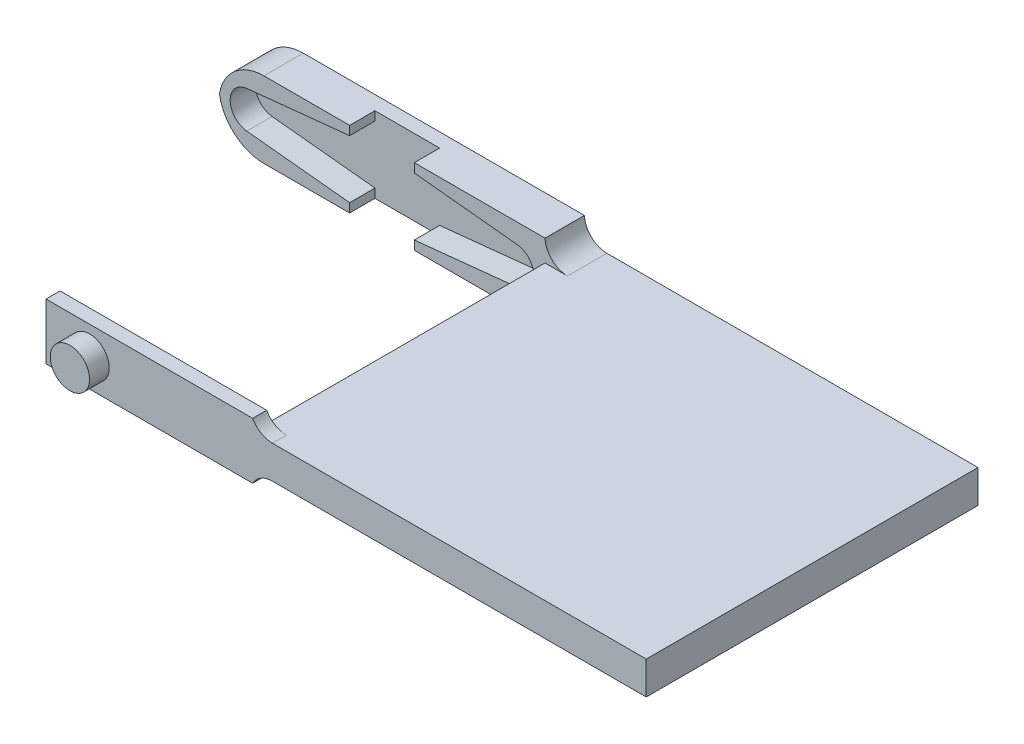
ISO-10303-21;
HEADER;
FILE_DESCRIPTION(('STEP AP214'),'2;1');
FILE_NAME('part.step','',(''),(''),'','','');
FILE_SCHEMA(('AUTOMOTIVE_DESIGN { 1 0 10303 214 1 1 1 1 }'));
ENDSEC;
DATA;
#1=APPLICATION_CONTEXT('core data for automotive mechanical design processes');
#2=APPLICATION_PROTOCOL_DEFINITION('international standard','automotive_design',2000,#1);
#3=PRODUCT_CONTEXT('',#1,'mechanical');
#4=PRODUCT('Part','Part','',(#3));
#5=PRODUCT_RELATED_PRODUCT_CATEGORY('part','',(#4));
#6=PRODUCT_DEFINITION_FORMATION('','',#4);
#7=PRODUCT_DEFINITION_CONTEXT('part definition',#1,'design');
#8=PRODUCT_DEFINITION('design','',#6,#7);
#9=PRODUCT_DEFINITION_SHAPE('','',#8);
#10=(LENGTH_UNIT() NAMED_UNIT(*) SI_UNIT(.MILLI.,.METRE.));
#11=(NAMED_UNIT(*) PLANE_ANGLE_UNIT() SI_UNIT($,.RADIAN.));
#12=(NAMED_UNIT(*) SI_UNIT($,.STERADIAN.) SOLID_ANGLE_UNIT());
#13=UNCERTAINTY_MEASURE_WITH_UNIT(LENGTH_MEASURE(1.E-05),#10,'distance_accuracy_value','');
#14=(GEOMETRIC_REPRESENTATION_CONTEXT(3) GLOBAL_UNCERTAINTY_ASSIGNED_CONTEXT((#13)) GLOBAL_UNIT_ASSIGNED_CONTEXT((#10,
#11,#12)) REPRESENTATION_CONTEXT('',''));
#15=CARTESIAN_POINT('',(0.,0.,0.));
#16=DIRECTION('',(0.,0.,1.));
#17=DIRECTION('',(1.,0.,0.));
#18=AXIS2_PLACEMENT_3D('',#15,#16,#17);
#19=CARTESIAN_POINT('',(0.,0.,3.5));
#20=DIRECTION('',(0.,0.,1.));
#21=DIRECTION('',(1.,0.,0.));
#22=AXIS2_PLACEMENT_3D('',#19,#20,#21);
#23=PLANE('',#22);
#24=DIRECTION('',(0.,1.,0.));
#25=VECTOR('',#24,1.);
#26=CARTESIAN_POINT('',(2.875,0.,3.5));
#27=LINE('',#26,#25);
#28=CARTESIAN_POINT('',(2.875,0.,3.5));
#29=VERTEX_POINT('',#28);
#30=CARTESIAN_POINT('',(2.875,0.795101343833628,3.5));
#31=VERTEX_POINT('',#30);
#32=EDGE_CURVE('E305',#29,#31,#27,.T.);
#33=ORIENTED_EDGE('',*,*,#32,.F.);
#34=DIRECTION('',(1.,0.,0.));
#35=VECTOR('',#34,1.);
#36=CARTESIAN_POINT('',(0.,0.,3.5));
#37=LINE('',#36,#35);
#38=CARTESIAN_POINT('',(14.5,0.,3.5));
#39=VERTEX_POINT('',#38);
#40=EDGE_CURVE('E517',#29,#39,#37,.T.);
#41=ORIENTED_EDGE('',*,*,#40,.T.);
#42=CARTESIAN_POINT('',(16.4981037237807,-0.0870718612048299,3.5));
#43=DIRECTION('',(0.,0.,1.));
#44=DIRECTION('',(1.,0.,0.));
#45=AXIS2_PLACEMENT_3D('',#42,#43,#44);
#46=CIRCLE('',#45,2.);
#47=CARTESIAN_POINT('',(16.4981037237807,1.91292813879517,3.5));
#48=VERTEX_POINT('',#47);
#49=EDGE_CURVE('E390',#39,#48,#46,.F.);
#50=ORIENTED_EDGE('',*,*,#49,.T.);
#51=DIRECTION('',(1.,0.,0.));
#52=VECTOR('',#51,1.);
#53=CARTESIAN_POINT('',(0.,1.91292813879517,3.5));
#54=LINE('',#53,#52);
#55=CARTESIAN_POINT('',(14.5,1.91292813879517,3.5));
#56=VERTEX_POINT('',#55);
#57=EDGE_CURVE('E757',#56,#48,#54,.T.);
#58=ORIENTED_EDGE('',*,*,#57,.F.);
#59=DIRECTION('',(0.,-1.,0.));
#60=VECTOR('',#59,1.);
#61=CARTESIAN_POINT('',(14.5,0.,3.5));
#62=LINE('',#61,#60);
#63=CARTESIAN_POINT('',(14.5,4.83707186120483,3.5));
#64=VERTEX_POINT('',#63);
#65=EDGE_CURVE('E347',#64,#56,#62,.T.);
#66=ORIENTED_EDGE('',*,*,#65,.F.);
#67=DIRECTION('',(-1.,0.,0.));
#68=VECTOR('',#67,1.);
#69=CARTESIAN_POINT('',(0.,4.83707186120483,3.5));
#70=LINE('',#69,#68);
#71=CARTESIAN_POINT('',(16.4981037237807,4.83707186120483,3.5));
#72=VERTEX_POINT('',#71);
#73=EDGE_CURVE('E382',#72,#64,#70,.T.);
#74=ORIENTED_EDGE('',*,*,#73,.F.);
#75=CARTESIAN_POINT('',(16.4981037237807,6.83707186120483,3.5));
#76=DIRECTION('',(0.,0.,1.));
#77=DIRECTION('',(1.,0.,0.));
#78=AXIS2_PLACEMENT_3D('',#75,#76,#77);
#79=CIRCLE('',#78,2.);
#80=CARTESIAN_POINT('',(14.5,6.75,3.5));
#81=VERTEX_POINT('',#80);
#82=EDGE_CURVE('E394',#72,#81,#79,.F.);
#83=ORIENTED_EDGE('',*,*,#82,.T.);
#84=DIRECTION('',(1.,0.,0.));
#85=VECTOR('',#84,1.);
#86=CARTESIAN_POINT('',(0.,6.75,3.5));
#87=LINE('',#86,#85);
#88=CARTESIAN_POINT('',(2.875,6.75,3.5));
#89=VERTEX_POINT('',#88);
#90=EDGE_CURVE('E515',#89,#81,#87,.T.);
#91=ORIENTED_EDGE('',*,*,#90,.F.);
#92=DIRECTION('',(0.,1.,0.));
#93=VECTOR('',#92,1.);
#94=CARTESIAN_POINT('',(2.875,6.75,3.5));
#95=LINE('',#94,#93);
#96=CARTESIAN_POINT('',(2.875,5.95489865616637,3.5));
#97=VERTEX_POINT('',#96);
#98=EDGE_CURVE('E527',#97,#89,#95,.T.);
#99=ORIENTED_EDGE('',*,*,#98,.F.);
#100=DIRECTION('',(-0.994773374070749,0.102107464173283,0.));
#101=VECTOR('',#100,1.);
#102=CARTESIAN_POINT('',(0.634836166584157,6.18483791100064,3.5));
#103=LINE('',#102,#101);
#104=CARTESIAN_POINT('',(12.0184773158859,5.01637606721673,3.5));
#105=VERTEX_POINT('',#104);
#106=EDGE_CURVE('E333',#105,#97,#103,.T.);
#107=ORIENTED_EDGE('',*,*,#106,.F.);
#108=CARTESIAN_POINT('',(11.85,3.375,3.5));
#109=DIRECTION('',(0.,0.,1.));
#110=DIRECTION('',(1.,0.,0.));
#111=AXIS2_PLACEMENT_3D('',#108,#109,#110);
#112=CIRCLE('',#111,1.64999999999999);
#113=CARTESIAN_POINT('',(12.0184773158859,1.73362393278327,3.5));
#114=VERTEX_POINT('',#113);
#115=EDGE_CURVE('E326',#105,#114,#112,.F.);
#116=ORIENTED_EDGE('',*,*,#115,.T.);
#117=DIRECTION('',(-0.994773374070749,-0.102107464173284,0.));
#118=VECTOR('',#117,1.);
#119=CARTESIAN_POINT('',(-0.0507868933267326,0.49478703288005,3.5));
#120=LINE('',#119,#118);
#121=EDGE_CURVE('E320',#114,#31,#120,.T.);
#122=ORIENTED_EDGE('',*,*,#121,.T.);
#123=EDGE_LOOP('',(#33,#41,#50,#58,#66,#74,#83,#91,#99,#107,#116,#122));
#124=FACE_BOUND('',#123,.T.);
#125=ADVANCED_FACE('F114',(#124),#23,.T.);
#126=CARTESIAN_POINT('',(0.,0.,29.5));
#127=DIRECTION('',(0.,0.,1.));
#128=DIRECTION('',(1.,0.,0.));
#129=AXIS2_PLACEMENT_3D('',#126,#127,#128);
#130=PLANE('',#129);
#131=DIRECTION('',(1.,0.,0.));
#132=VECTOR('',#131,1.);
#133=CARTESIAN_POINT('',(0.,4.83707186120483,29.5));
#134=LINE('',#133,#132);
#135=CARTESIAN_POINT('',(16.2534017605437,4.83707186120483,29.5));
#136=VERTEX_POINT('',#135);
#137=CARTESIAN_POINT('',(49.5,4.83707186120483,29.5));
#138=VERTEX_POINT('',#137);
#139=EDGE_CURVE('E476',#136,#138,#134,.T.);
#140=ORIENTED_EDGE('',*,*,#139,.F.);
#141=CARTESIAN_POINT('',(16.2534017605437,6.83707186120483,29.5));
#142=DIRECTION('',(0.,0.,1.));
#143=DIRECTION('',(1.,0.,0.));
#144=AXIS2_PLACEMENT_3D('',#141,#142,#143);
#145=CIRCLE('',#144,2.);
#146=CARTESIAN_POINT('',(14.5,5.875,29.5));
#147=VERTEX_POINT('',#146);
#148=EDGE_CURVE('E403',#136,#147,#145,.F.);
#149=ORIENTED_EDGE('',*,*,#148,.T.);
#150=DIRECTION('',(-1.,0.,0.));
#151=VECTOR('',#150,1.);
#152=CARTESIAN_POINT('',(13.5,5.875,29.5));
#153=LINE('',#152,#151);
#154=CARTESIAN_POINT('',(-3.875,5.875,29.5));
#155=VERTEX_POINT('',#154);
#156=EDGE_CURVE('E453',#147,#155,#153,.T.);
#157=ORIENTED_EDGE('',*,*,#156,.T.);
#158=DIRECTION('',(0.,-1.,0.));
#159=VECTOR('',#158,1.);
#160=CARTESIAN_POINT('',(-3.875,5.875,29.5));
#161=LINE('',#160,#159);
#162=CARTESIAN_POINT('',(-3.875,0.875000000000001,29.5));
#163=VERTEX_POINT('',#162);
#164=EDGE_CURVE('E464',#155,#163,#161,.T.);
#165=ORIENTED_EDGE('',*,*,#164,.T.);
#166=DIRECTION('',(-1.,0.,0.));
#167=VECTOR('',#166,1.);
#168=CARTESIAN_POINT('',(14.5,0.874999999999997,29.5));
#169=LINE('',#168,#167);
#170=CARTESIAN_POINT('',(14.5,0.874999999999997,29.5));
#171=VERTEX_POINT('',#170);
#172=EDGE_CURVE('E447',#171,#163,#169,.T.);
#173=ORIENTED_EDGE('',*,*,#172,.F.);
#174=CARTESIAN_POINT('',(16.2534017605437,-0.0870718612048299,29.5));
#175=DIRECTION('',(0.,0.,1.));
#176=DIRECTION('',(1.,0.,0.));
#177=AXIS2_PLACEMENT_3D('',#174,#175,#176);
#178=CIRCLE('',#177,2.);
#179=CARTESIAN_POINT('',(16.2534017605437,1.91292813879517,29.5));
#180=VERTEX_POINT('',#179);
#181=EDGE_CURVE('E399',#171,#180,#178,.F.);
#182=ORIENTED_EDGE('',*,*,#181,.T.);
#183=DIRECTION('',(1.,0.,0.));
#184=VECTOR('',#183,1.);
#185=CARTESIAN_POINT('',(0.,1.91292813879517,29.5));
#186=LINE('',#185,#184);
#187=CARTESIAN_POINT('',(49.5,1.91292813879517,29.5));
#188=VERTEX_POINT('',#187);
#189=EDGE_CURVE('E478',#180,#188,#186,.T.);
#190=ORIENTED_EDGE('',*,*,#189,.T.);
#191=DIRECTION('',(0.,-1.,0.));
#192=VECTOR('',#191,1.);
#193=CARTESIAN_POINT('',(49.5,0.,29.5));
#194=LINE('',#193,#192);
#195=EDGE_CURVE('E481',#138,#188,#194,.T.);
#196=ORIENTED_EDGE('',*,*,#195,.F.);
#197=EDGE_LOOP('',(#140,#149,#157,#165,#173,#182,#190,#196));
#198=FACE_BOUND('',#197,.T.);
#199=CARTESIAN_POINT('',(0.,3.375,29.5));
#200=DIRECTION('',(0.,0.,1.));
#201=DIRECTION('',(1.,0.,0.));
#202=AXIS2_PLACEMENT_3D('',#199,#200,#201);
#203=CIRCLE('',#202,1.75);
#204=CARTESIAN_POINT('',(1.75,3.375,29.5));
#205=VERTEX_POINT('',#204);
#206=EDGE_CURVE('E431',#205,#205,#203,.T.);
#207=ORIENTED_EDGE('',*,*,#206,.F.);
#208=EDGE_LOOP('',(#207));
#209=FACE_BOUND('',#208,.T.);
#210=ADVANCED_FACE('F569',(#198,#209),#130,.T.);
#211=CARTESIAN_POINT('',(0.634836166584157,6.18483791100064,3.5));
#212=DIRECTION('',(-0.102107464173283,-0.994773374070749,0.));
#213=DIRECTION('',(0.994773374070749,-0.102107464173283,0.));
#214=AXIS2_PLACEMENT_3D('',#211,#212,#213);
#215=PLANE('',#214);
#216=DIRECTION('',(0.,0.,1.));
#217=VECTOR('',#216,1.);
#218=CARTESIAN_POINT('',(2.875,5.95489865616637,-4.55471240863542));
#219=LINE('',#218,#217);
#220=CARTESIAN_POINT('',(2.875,5.95489865616637,1.25));
#221=VERTEX_POINT('',#220);
#222=EDGE_CURVE('E524',#221,#97,#219,.T.);
#223=ORIENTED_EDGE('',*,*,#222,.F.);
#224=DIRECTION('',(-0.994773374070749,0.102107464173283,0.));
#225=VECTOR('',#224,1.);
#226=CARTESIAN_POINT('',(0.634836166584157,6.18483791100064,1.25));
#227=LINE('',#226,#225);
#228=CARTESIAN_POINT('',(12.0184773158859,5.01637606721673,1.25));
#229=VERTEX_POINT('',#228);
#230=EDGE_CURVE('E501',#229,#221,#227,.T.);
#231=ORIENTED_EDGE('',*,*,#230,.F.);
#232=DIRECTION('',(0.,0.,-1.));
#233=VECTOR('',#232,1.);
#234=CARTESIAN_POINT('',(12.0184773158859,5.01637606721673,3.5));
#235=LINE('',#234,#233);
#236=EDGE_CURVE('E357',#105,#229,#235,.T.);
#237=ORIENTED_EDGE('',*,*,#236,.F.);
#238=ORIENTED_EDGE('',*,*,#106,.T.);
#239=EDGE_LOOP('',(#223,#231,#237,#238));
#240=FACE_BOUND('',#239,.T.);
#241=ADVANCED_FACE('F522',(#240),#215,.T.);
#242=CARTESIAN_POINT('',(11.85,3.375,3.5));
#243=DIRECTION('',(0.,0.,-1.));
#244=DIRECTION('',(-1.,0.,0.));
#245=AXIS2_PLACEMENT_3D('',#242,#243,#244);
#246=CYLINDRICAL_SURFACE('',#245,1.64999999999999);
#247=ORIENTED_EDGE('',*,*,#236,.T.);
#248=CARTESIAN_POINT('',(11.85,3.375,1.25));
#249=DIRECTION('',(0.,0.,1.));
#250=DIRECTION('',(1.,0.,0.));
#251=AXIS2_PLACEMENT_3D('',#248,#249,#250);
#252=CIRCLE('',#251,1.64999999999999);
#253=CARTESIAN_POINT('',(12.0184773158859,1.73362393278327,1.25));
#254=VERTEX_POINT('',#253);
#255=EDGE_CURVE('E498',#229,#254,#252,.F.);
#256=ORIENTED_EDGE('',*,*,#255,.T.);
#257=DIRECTION('',(0.,0.,-1.));
#258=VECTOR('',#257,1.);
#259=CARTESIAN_POINT('',(12.0184773158859,1.73362393278327,3.5));
#260=LINE('',#259,#258);
#261=EDGE_CURVE('E355',#114,#254,#260,.T.);
#262=ORIENTED_EDGE('',*,*,#261,.F.);
#263=ORIENTED_EDGE('',*,*,#115,.F.);
#264=EDGE_LOOP('',(#247,#256,#262,#263));
#265=FACE_BOUND('',#264,.T.);
#266=ADVANCED_FACE('F561',(#265),#246,.F.);
#267=CARTESIAN_POINT('',(-0.0507868933267326,0.49478703288005,3.5));
#268=DIRECTION('',(0.102107464173283,-0.994773374070749,0.));
#269=DIRECTION('',(0.994773374070749,0.102107464173284,0.));
#270=AXIS2_PLACEMENT_3D('',#267,#268,#269);
#271=PLANE('',#270);
#272=DIRECTION('',(-0.994773374070749,-0.102107464173284,0.));
#273=VECTOR('',#272,1.);
#274=CARTESIAN_POINT('',(-0.0507868933267326,0.49478703288005,1.25));
#275=LINE('',#274,#273);
#276=CARTESIAN_POINT('',(2.875,0.795101343833628,1.25));
#277=VERTEX_POINT('',#276);
#278=EDGE_CURVE('E322',#254,#277,#275,.T.);
#279=ORIENTED_EDGE('',*,*,#278,.T.);
#280=DIRECTION('',(0.,0.,1.));
#281=VECTOR('',#280,1.);
#282=CARTESIAN_POINT('',(2.875,0.795101343833628,-4.55471240863542));
#283=LINE('',#282,#281);
#284=EDGE_CURVE('E308',#277,#31,#283,.T.);
#285=ORIENTED_EDGE('',*,*,#284,.T.);
#286=ORIENTED_EDGE('',*,*,#121,.F.);
#287=ORIENTED_EDGE('',*,*,#261,.T.);
#288=EDGE_LOOP('',(#279,#285,#286,#287));
#289=FACE_BOUND('',#288,.T.);
#290=ADVANCED_FACE('F318',(#289),#271,.F.);
#291=CARTESIAN_POINT('',(0.0507868933267324,0.49478703288005,3.5));
#292=DIRECTION('',(0.102107464173283,0.994773374070749,0.));
#293=DIRECTION('',(-0.994773374070749,0.102107464173283,0.));
#294=AXIS2_PLACEMENT_3D('',#291,#292,#293);
#295=PLANE('',#294);
#296=DIRECTION('',(0.,0.,1.));
#297=VECTOR('',#296,1.);
#298=CARTESIAN_POINT('',(-2.875,0.795101343833628,-4.55471240863542));
#299=LINE('',#298,#297);
#300=CARTESIAN_POINT('',(-2.875,0.795101343833628,1.25));
#301=VERTEX_POINT('',#300);
#302=CARTESIAN_POINT('',(-2.87500000000002,0.795101343833628,3.5));
#303=VERTEX_POINT('',#302);
#304=EDGE_CURVE('E130',#301,#303,#299,.T.);
#305=ORIENTED_EDGE('',*,*,#304,.F.);
#306=DIRECTION('',(0.994773374070749,-0.102107464173283,0.));
#307=VECTOR('',#306,1.);
#308=CARTESIAN_POINT('',(0.0507868933267324,0.49478703288005,1.25));
#309=LINE('',#308,#307);
#310=CARTESIAN_POINT('',(-12.0184773158859,1.73362393278327,1.25));
#311=VERTEX_POINT('',#310);
#312=EDGE_CURVE('E509',#311,#301,#309,.T.);
#313=ORIENTED_EDGE('',*,*,#312,.F.);
#314=DIRECTION('',(0.,0.,-1.));
#315=VECTOR('',#314,1.);
#316=CARTESIAN_POINT('',(-12.0184773158859,1.73362393278327,3.5));
#317=LINE('',#316,#315);
#318=CARTESIAN_POINT('',(-12.0184773158859,1.73362393278327,3.5));
#319=VERTEX_POINT('',#318);
#320=EDGE_CURVE('E351',#319,#311,#317,.T.);
#321=ORIENTED_EDGE('',*,*,#320,.F.);
#322=DIRECTION('',(0.994773374070749,-0.102107464173283,0.));
#323=VECTOR('',#322,1.);
#324=CARTESIAN_POINT('',(0.0507868933267324,0.49478703288005,3.5));
#325=LINE('',#324,#323);
#326=EDGE_CURVE('E328',#319,#303,#325,.T.);
#327=ORIENTED_EDGE('',*,*,#326,.T.);
#328=EDGE_LOOP('',(#305,#313,#321,#327));
#329=FACE_BOUND('',#328,.T.);
#330=ADVANCED_FACE('F552',(#329),#295,.T.);
#331=CARTESIAN_POINT('',(-11.85,3.375,3.5));
#332=DIRECTION('',(0.,0.,-1.));
#333=DIRECTION('',(-1.,0.,0.));
#334=AXIS2_PLACEMENT_3D('',#331,#332,#333);
#335=CYLINDRICAL_SURFACE('',#334,1.65);
#336=CARTESIAN_POINT('',(-11.85,3.375,1.25));
#337=DIRECTION('',(0.,0.,1.));
#338=DIRECTION('',(1.,0.,0.));
#339=AXIS2_PLACEMENT_3D('',#336,#337,#338);
#340=CIRCLE('',#339,1.65);
#341=CARTESIAN_POINT('',(-12.0184773158859,5.01637606721673,1.25));
#342=VERTEX_POINT('',#341);
#343=EDGE_CURVE('E507',#342,#311,#340,.T.);
#344=ORIENTED_EDGE('',*,*,#343,.F.);
#345=DIRECTION('',(0.,0.,-1.));
#346=VECTOR('',#345,1.);
#347=CARTESIAN_POINT('',(-12.0184773158859,5.01637606721673,3.5));
#348=LINE('',#347,#346);
#349=CARTESIAN_POINT('',(-12.0184773158859,5.01637606721673,3.5));
#350=VERTEX_POINT('',#349);
#351=EDGE_CURVE('E348',#350,#342,#348,.T.);
#352=ORIENTED_EDGE('',*,*,#351,.F.);
#353=CARTESIAN_POINT('',(-11.85,3.375,3.5));
#354=DIRECTION('',(0.,0.,1.));
#355=DIRECTION('',(1.,0.,0.));
#356=AXIS2_PLACEMENT_3D('',#353,#354,#355);
#357=CIRCLE('',#356,1.65);
#358=EDGE_CURVE('E331',#350,#319,#357,.T.);
#359=ORIENTED_EDGE('',*,*,#358,.T.);
#360=ORIENTED_EDGE('',*,*,#320,.T.);
#361=EDGE_LOOP('',(#344,#352,#359,#360));
#362=FACE_BOUND('',#361,.T.);
#363=ADVANCED_FACE('F547',(#362),#335,.F.);
#364=CARTESIAN_POINT('',(0.,6.75,3.5));
#365=DIRECTION('',(0.,1.,0.));
#366=DIRECTION('',(0.,0.,1.));
#367=AXIS2_PLACEMENT_3D('',#364,#365,#366);
#368=PLANE('',#367);
#369=DIRECTION('',(0.,0.,1.));
#370=VECTOR('',#369,1.);
#371=CARTESIAN_POINT('',(2.875,6.75,-4.55471240863542));
#372=LINE('',#371,#370);
#373=CARTESIAN_POINT('',(2.875,6.75,1.25));
#374=VERTEX_POINT('',#373);
#375=EDGE_CURVE('E537',#374,#89,#372,.T.);
#376=ORIENTED_EDGE('',*,*,#375,.T.);
#377=ORIENTED_EDGE('',*,*,#90,.T.);
#378=DIRECTION('',(0.,0.,-1.));
#379=VECTOR('',#378,1.);
#380=CARTESIAN_POINT('',(14.5,6.75,3.5));
#381=LINE('',#380,#379);
#382=CARTESIAN_POINT('',(14.5,6.75,0.));
#383=VERTEX_POINT('',#382);
#384=EDGE_CURVE('E352',#81,#383,#381,.T.);
#385=ORIENTED_EDGE('',*,*,#384,.T.);
#386=DIRECTION('',(1.,0.,0.));
#387=VECTOR('',#386,1.);
#388=CARTESIAN_POINT('',(0.,6.75,0.));
#389=LINE('',#388,#387);
#390=CARTESIAN_POINT('',(-10.5,6.75,0.));
#391=VERTEX_POINT('',#390);
#392=EDGE_CURVE('E343',#391,#383,#389,.T.);
#393=ORIENTED_EDGE('',*,*,#392,.F.);
#394=DIRECTION('',(0.,0.,-1.));
#395=VECTOR('',#394,1.);
#396=CARTESIAN_POINT('',(-10.5,6.75,3.5));
#397=LINE('',#396,#395);
#398=CARTESIAN_POINT('',(-10.5,6.75,3.5));
#399=VERTEX_POINT('',#398);
#400=EDGE_CURVE('E409',#391,#399,#397,.F.);
#401=ORIENTED_EDGE('',*,*,#400,.T.);
#402=CARTESIAN_POINT('',(-2.875,6.75,3.5));
#403=VERTEX_POINT('',#402);
#404=EDGE_CURVE('E421',#399,#403,#87,.T.);
#405=ORIENTED_EDGE('',*,*,#404,.T.);
#406=DIRECTION('',(0.,0.,1.));
#407=VECTOR('',#406,1.);
#408=CARTESIAN_POINT('',(-2.875,6.75,-4.55471240863542));
#409=LINE('',#408,#407);
#410=CARTESIAN_POINT('',(-2.875,6.75,1.25));
#411=VERTEX_POINT('',#410);
#412=EDGE_CURVE('E138',#411,#403,#409,.T.);
#413=ORIENTED_EDGE('',*,*,#412,.F.);
#414=DIRECTION('',(1.,0.,0.));
#415=VECTOR('',#414,1.);
#416=CARTESIAN_POINT('',(-2.875,6.75,1.25));
#417=LINE('',#416,#415);
#418=EDGE_CURVE('E436',#411,#374,#417,.T.);
#419=ORIENTED_EDGE('',*,*,#418,.T.);
#420=EDGE_LOOP('',(#376,#377,#385,#393,#401,#405,#413,#419));
#421=FACE_BOUND('',#420,.T.);
#422=ADVANCED_FACE('F592',(#421),#368,.T.);
#423=CARTESIAN_POINT('',(0.,0.,3.5));
#424=DIRECTION('',(0.,1.,0.));
#425=DIRECTION('',(-1.,0.,0.));
#426=AXIS2_PLACEMENT_3D('',#423,#424,#425);
#427=PLANE('',#426);
#428=ORIENTED_EDGE('',*,*,#40,.F.);
#429=DIRECTION('',(0.,0.,1.));
#430=VECTOR('',#429,1.);
#431=CARTESIAN_POINT('',(2.875,0.,-4.55471240863542));
#432=LINE('',#431,#430);
#433=CARTESIAN_POINT('',(2.875,0.,1.25));
#434=VERTEX_POINT('',#433);
#435=EDGE_CURVE('E311',#434,#29,#432,.T.);
#436=ORIENTED_EDGE('',*,*,#435,.F.);
#437=DIRECTION('',(-1.,0.,0.));
#438=VECTOR('',#437,1.);
#439=CARTESIAN_POINT('',(-2.875,0.,1.25));
#440=LINE('',#439,#438);
#441=CARTESIAN_POINT('',(-2.875,0.,1.25));
#442=VERTEX_POINT('',#441);
#443=EDGE_CURVE('E774',#434,#442,#440,.T.);
#444=ORIENTED_EDGE('',*,*,#443,.T.);
#445=DIRECTION('',(0.,0.,1.));
#446=VECTOR('',#445,1.);
#447=CARTESIAN_POINT('',(-2.875,0.,-4.55471240863542));
#448=LINE('',#447,#446);
#449=CARTESIAN_POINT('',(-2.875,0.,3.5));
#450=VERTEX_POINT('',#449);
#451=EDGE_CURVE('E553',#442,#450,#448,.T.);
#452=ORIENTED_EDGE('',*,*,#451,.T.);
#453=CARTESIAN_POINT('',(-10.5,0.,3.5));
#454=VERTEX_POINT('',#453);
#455=EDGE_CURVE('E518',#454,#450,#37,.T.);
#456=ORIENTED_EDGE('',*,*,#455,.F.);
#457=DIRECTION('',(0.,0.,-1.));
#458=VECTOR('',#457,1.);
#459=CARTESIAN_POINT('',(-10.5,0.,0.));
#460=LINE('',#459,#458);
#461=CARTESIAN_POINT('',(-10.5,0.,0.));
#462=VERTEX_POINT('',#461);
#463=EDGE_CURVE('E12',#454,#462,#460,.T.);
#464=ORIENTED_EDGE('',*,*,#463,.T.);
#465=DIRECTION('',(1.,0.,0.));
#466=VECTOR('',#465,1.);
#467=CARTESIAN_POINT('',(0.,0.,0.));
#468=LINE('',#467,#466);
#469=CARTESIAN_POINT('',(14.5,0.,0.));
#470=VERTEX_POINT('',#469);
#471=EDGE_CURVE('E345',#462,#470,#468,.T.);
#472=ORIENTED_EDGE('',*,*,#471,.T.);
#473=DIRECTION('',(0.,0.,-1.));
#474=VECTOR('',#473,1.);
#475=CARTESIAN_POINT('',(14.5,0.,3.5));
#476=LINE('',#475,#474);
#477=EDGE_CURVE('E342',#39,#470,#476,.T.);
#478=ORIENTED_EDGE('',*,*,#477,.F.);
#479=EDGE_LOOP('',(#428,#436,#444,#452,#456,#464,#472,#478));
#480=FACE_BOUND('',#479,.T.);
#481=ADVANCED_FACE('F587',(#480),#427,.F.);
#482=CARTESIAN_POINT('',(-0.634836166584157,6.18483791100064,3.5));
#483=DIRECTION('',(-0.102107464173283,0.994773374070749,0.));
#484=DIRECTION('',(-0.994773374070749,-0.102107464173283,0.));
#485=AXIS2_PLACEMENT_3D('',#482,#483,#484);
#486=PLANE('',#485);
#487=DIRECTION('',(0.994773374070749,0.102107464173283,0.));
#488=VECTOR('',#487,1.);
#489=CARTESIAN_POINT('',(-0.634836166584157,6.18483791100064,1.25));
#490=LINE('',#489,#488);
#491=CARTESIAN_POINT('',(-2.875,5.95489865616637,1.25));
#492=VERTEX_POINT('',#491);
#493=EDGE_CURVE('E504',#342,#492,#490,.T.);
#494=ORIENTED_EDGE('',*,*,#493,.T.);
#495=DIRECTION('',(0.,0.,1.));
#496=VECTOR('',#495,1.);
#497=CARTESIAN_POINT('',(-2.875,5.95489865616637,-4.55471240863542));
#498=LINE('',#497,#496);
#499=CARTESIAN_POINT('',(-2.875,5.95489865616637,3.5));
#500=VERTEX_POINT('',#499);
#501=EDGE_CURVE('E533',#492,#500,#498,.T.);
#502=ORIENTED_EDGE('',*,*,#501,.T.);
#503=DIRECTION('',(0.994773374070749,0.102107464173283,0.));
#504=VECTOR('',#503,1.);
#505=CARTESIAN_POINT('',(-0.634836166584157,6.18483791100064,3.5));
#506=LINE('',#505,#504);
#507=EDGE_CURVE('E339',#350,#500,#506,.T.);
#508=ORIENTED_EDGE('',*,*,#507,.F.);
#509=ORIENTED_EDGE('',*,*,#351,.T.);
#510=EDGE_LOOP('',(#494,#502,#508,#509));
#511=FACE_BOUND('',#510,.T.);
#512=ADVANCED_FACE('F542',(#511),#486,.F.);
#513=DIRECTION('',(0.,-1.,0.));
#514=VECTOR('',#513,1.);
#515=CARTESIAN_POINT('',(-2.875,0.,3.5));
#516=LINE('',#515,#514);
#517=EDGE_CURVE('E315',#303,#450,#516,.T.);
#518=ORIENTED_EDGE('',*,*,#517,.F.);
#519=ORIENTED_EDGE('',*,*,#326,.F.);
#520=ORIENTED_EDGE('',*,*,#358,.F.);
#521=ORIENTED_EDGE('',*,*,#507,.T.);
#522=DIRECTION('',(0.,-1.,0.));
#523=VECTOR('',#522,1.);
#524=CARTESIAN_POINT('',(-2.875,6.75,3.5));
#525=LINE('',#524,#523);
#526=EDGE_CURVE('E531',#403,#500,#525,.T.);
#527=ORIENTED_EDGE('',*,*,#526,.F.);
#528=ORIENTED_EDGE('',*,*,#404,.F.);
#529=CARTESIAN_POINT('',(-10.5,2.75,3.5));
#530=DIRECTION('',(0.,0.,1.));
#531=DIRECTION('',(1.,0.,0.));
#532=AXIS2_PLACEMENT_3D('',#529,#530,#531);
#533=CIRCLE('',#532,4.);
#534=CARTESIAN_POINT('',(-14.4508701573198,3.375,3.5));
#535=VERTEX_POINT('',#534);
#536=EDGE_CURVE('E123',#399,#535,#533,.T.);
#537=ORIENTED_EDGE('',*,*,#536,.T.);
#538=CARTESIAN_POINT('',(-10.5,4.,3.5));
#539=DIRECTION('',(0.,0.,1.));
#540=DIRECTION('',(1.,0.,0.));
#541=AXIS2_PLACEMENT_3D('',#538,#539,#540);
#542=CIRCLE('',#541,4.);
#543=EDGE_CURVE('E412',#535,#454,#542,.T.);
#544=ORIENTED_EDGE('',*,*,#543,.T.);
#545=ORIENTED_EDGE('',*,*,#455,.T.);
#546=EDGE_LOOP('',(#518,#519,#520,#521,#527,#528,#537,#544,#545));
#547=FACE_BOUND('',#546,.T.);
#548=ADVANCED_FACE('F417',(#547),#23,.T.);
#549=CARTESIAN_POINT('',(0.,0.,0.));
#550=DIRECTION('',(0.,0.,1.));
#551=DIRECTION('',(1.,0.,0.));
#552=AXIS2_PLACEMENT_3D('',#549,#550,#551);
#553=PLANE('',#552);
#554=CARTESIAN_POINT('',(-10.5,4.,0.));
#555=DIRECTION('',(0.,0.,1.));
#556=DIRECTION('',(1.,0.,0.));
#557=AXIS2_PLACEMENT_3D('',#554,#555,#556);
#558=CIRCLE('',#557,4.);
#559=CARTESIAN_POINT('',(-14.4508701573198,3.375,0.));
#560=VERTEX_POINT('',#559);
#561=EDGE_CURVE('E405',#462,#560,#558,.F.);
#562=ORIENTED_EDGE('',*,*,#561,.T.);
#563=CARTESIAN_POINT('',(-10.5,2.75,0.));
#564=DIRECTION('',(0.,0.,1.));
#565=DIRECTION('',(1.,0.,0.));
#566=AXIS2_PLACEMENT_3D('',#563,#564,#565);
#567=CIRCLE('',#566,4.);
#568=EDGE_CURVE('E407',#560,#391,#567,.F.);
#569=ORIENTED_EDGE('',*,*,#568,.T.);
#570=ORIENTED_EDGE('',*,*,#392,.T.);
#571=CARTESIAN_POINT('',(16.4981037237807,6.83707186120483,0.));
#572=DIRECTION('',(0.,0.,1.));
#573=DIRECTION('',(1.,0.,0.));
#574=AXIS2_PLACEMENT_3D('',#571,#572,#573);
#575=CIRCLE('',#574,2.);
#576=CARTESIAN_POINT('',(16.4981037237807,4.83707186120483,0.));
#577=VERTEX_POINT('',#576);
#578=EDGE_CURVE('E392',#383,#577,#575,.T.);
#579=ORIENTED_EDGE('',*,*,#578,.T.);
#580=DIRECTION('',(1.,0.,0.));
#581=VECTOR('',#580,1.);
#582=CARTESIAN_POINT('',(0.,4.83707186120483,0.));
#583=LINE('',#582,#581);
#584=CARTESIAN_POINT('',(49.5,4.83707186120483,0.));
#585=VERTEX_POINT('',#584);
#586=EDGE_CURVE('E370',#577,#585,#583,.T.);
#587=ORIENTED_EDGE('',*,*,#586,.T.);
#588=DIRECTION('',(0.,-1.,0.));
#589=VECTOR('',#588,1.);
#590=CARTESIAN_POINT('',(49.5,0.,0.));
#591=LINE('',#590,#589);
#592=CARTESIAN_POINT('',(49.5,1.91292813879517,0.));
#593=VERTEX_POINT('',#592);
#594=EDGE_CURVE('E479',#585,#593,#591,.T.);
#595=ORIENTED_EDGE('',*,*,#594,.T.);
#596=DIRECTION('',(1.,0.,0.));
#597=VECTOR('',#596,1.);
#598=CARTESIAN_POINT('',(0.,1.91292813879517,0.));
#599=LINE('',#598,#597);
#600=CARTESIAN_POINT('',(16.4981037237807,1.91292813879517,0.));
#601=VERTEX_POINT('',#600);
#602=EDGE_CURVE('E373',#601,#593,#599,.T.);
#603=ORIENTED_EDGE('',*,*,#602,.F.);
#604=CARTESIAN_POINT('',(16.4981037237807,-0.0870718612048299,0.));
#605=DIRECTION('',(0.,0.,1.));
#606=DIRECTION('',(1.,0.,0.));
#607=AXIS2_PLACEMENT_3D('',#604,#605,#606);
#608=CIRCLE('',#607,2.);
#609=EDGE_CURVE('E387',#601,#470,#608,.T.);
#610=ORIENTED_EDGE('',*,*,#609,.T.);
#611=ORIENTED_EDGE('',*,*,#471,.F.);
#612=EDGE_LOOP('',(#562,#569,#570,#579,#587,#595,#603,#610,#611));
#613=FACE_BOUND('',#612,.T.);
#614=ADVANCED_FACE('F581',(#613),#553,.F.);
#615=CARTESIAN_POINT('',(0.,0.,1.25));
#616=DIRECTION('',(0.,0.,1.));
#617=DIRECTION('',(1.,0.,0.));
#618=AXIS2_PLACEMENT_3D('',#615,#616,#617);
#619=PLANE('',#618);
#620=ORIENTED_EDGE('',*,*,#312,.T.);
#621=DIRECTION('',(0.,1.,0.));
#622=VECTOR('',#621,1.);
#623=CARTESIAN_POINT('',(-2.875,0.,1.25));
#624=LINE('',#623,#622);
#625=EDGE_CURVE('E773',#442,#301,#624,.T.);
#626=ORIENTED_EDGE('',*,*,#625,.F.);
#627=ORIENTED_EDGE('',*,*,#443,.F.);
#628=DIRECTION('',(0.,-1.,0.));
#629=VECTOR('',#628,1.);
#630=CARTESIAN_POINT('',(2.875,0.,1.25));
#631=LINE('',#630,#629);
#632=EDGE_CURVE('E534',#277,#434,#631,.T.);
#633=ORIENTED_EDGE('',*,*,#632,.F.);
#634=ORIENTED_EDGE('',*,*,#278,.F.);
#635=ORIENTED_EDGE('',*,*,#255,.F.);
#636=ORIENTED_EDGE('',*,*,#230,.T.);
#637=DIRECTION('',(0.,-1.,0.));
#638=VECTOR('',#637,1.);
#639=CARTESIAN_POINT('',(2.875,6.75,1.25));
#640=LINE('',#639,#638);
#641=EDGE_CURVE('E441',#374,#221,#640,.T.);
#642=ORIENTED_EDGE('',*,*,#641,.F.);
#643=ORIENTED_EDGE('',*,*,#418,.F.);
#644=DIRECTION('',(0.,1.,0.));
#645=VECTOR('',#644,1.);
#646=CARTESIAN_POINT('',(-2.875,6.75,1.25));
#647=LINE('',#646,#645);
#648=EDGE_CURVE('E432',#492,#411,#647,.T.);
#649=ORIENTED_EDGE('',*,*,#648,.F.);
#650=ORIENTED_EDGE('',*,*,#493,.F.);
#651=ORIENTED_EDGE('',*,*,#343,.T.);
#652=EDGE_LOOP('',(#620,#626,#627,#633,#634,#635,#636,#642,#643,#649,#650,#651));
#653=FACE_BOUND('',#652,.T.);
#654=ADVANCED_FACE('F550',(#653),#619,.T.);
#655=CARTESIAN_POINT('',(14.5,0.,29.5));
#656=DIRECTION('',(1.,0.,0.));
#657=DIRECTION('',(0.,0.,-1.));
#658=AXIS2_PLACEMENT_3D('',#655,#656,#657);
#659=PLANE('',#658);
#660=DIRECTION('',(0.,0.,-1.));
#661=VECTOR('',#660,1.);
#662=CARTESIAN_POINT('',(14.5,1.91292813879517,29.5));
#663=LINE('',#662,#661);
#664=CARTESIAN_POINT('',(14.5,1.91292813879517,28.25));
#665=VERTEX_POINT('',#664);
#666=EDGE_CURVE('E492',#665,#56,#663,.T.);
#667=ORIENTED_EDGE('',*,*,#666,.F.);
#668=DIRECTION('',(0.,-1.,0.));
#669=VECTOR('',#668,1.);
#670=CARTESIAN_POINT('',(14.5,5.875,28.25));
#671=LINE('',#670,#669);
#672=CARTESIAN_POINT('',(14.5,4.83707186120483,28.25));
#673=VERTEX_POINT('',#672);
#674=EDGE_CURVE('E452',#673,#665,#671,.T.);
#675=ORIENTED_EDGE('',*,*,#674,.F.);
#676=DIRECTION('',(0.,0.,-1.));
#677=VECTOR('',#676,1.);
#678=CARTESIAN_POINT('',(14.5,4.83707186120483,29.5));
#679=LINE('',#678,#677);
#680=EDGE_CURVE('E495',#673,#64,#679,.T.);
#681=ORIENTED_EDGE('',*,*,#680,.T.);
#682=ORIENTED_EDGE('',*,*,#65,.T.);
#683=EDGE_LOOP('',(#667,#675,#681,#682));
#684=FACE_BOUND('',#683,.T.);
#685=ADVANCED_FACE('F639',(#684),#659,.F.);
#686=CARTESIAN_POINT('',(0.,4.83707186120483,29.5));
#687=DIRECTION('',(0.,1.,0.));
#688=DIRECTION('',(0.,0.,1.));
#689=AXIS2_PLACEMENT_3D('',#686,#687,#688);
#690=PLANE('',#689);
#691=ORIENTED_EDGE('',*,*,#586,.F.);
#692=DIRECTION('',(0.,0.,-1.));
#693=VECTOR('',#692,1.);
#694=CARTESIAN_POINT('',(16.4981037237807,4.83707186120483,3.5));
#695=LINE('',#694,#693);
#696=EDGE_CURVE('E384',#577,#72,#695,.F.);
#697=ORIENTED_EDGE('',*,*,#696,.T.);
#698=ORIENTED_EDGE('',*,*,#73,.T.);
#699=ORIENTED_EDGE('',*,*,#680,.F.);
#700=DIRECTION('',(1.,0.,0.));
#701=VECTOR('',#700,1.);
#702=CARTESIAN_POINT('',(0.,4.83707186120483,28.25));
#703=LINE('',#702,#701);
#704=CARTESIAN_POINT('',(16.2534017605437,4.83707186120483,28.25));
#705=VERTEX_POINT('',#704);
#706=EDGE_CURVE('E379',#673,#705,#703,.T.);
#707=ORIENTED_EDGE('',*,*,#706,.T.);
#708=DIRECTION('',(0.,0.,1.));
#709=VECTOR('',#708,1.);
#710=CARTESIAN_POINT('',(16.2534017605437,4.83707186120483,29.5));
#711=LINE('',#710,#709);
#712=EDGE_CURVE('E377',#705,#136,#711,.T.);
#713=ORIENTED_EDGE('',*,*,#712,.T.);
#714=ORIENTED_EDGE('',*,*,#139,.T.);
#715=DIRECTION('',(0.,0.,-1.));
#716=VECTOR('',#715,1.);
#717=CARTESIAN_POINT('',(49.5,4.83707186120483,29.5));
#718=LINE('',#717,#716);
#719=EDGE_CURVE('E484',#138,#585,#718,.T.);
#720=ORIENTED_EDGE('',*,*,#719,.T.);
#721=EDGE_LOOP('',(#691,#697,#698,#699,#707,#713,#714,#720));
#722=FACE_BOUND('',#721,.T.);
#723=ADVANCED_FACE('F713',(#722),#690,.T.);
#724=CARTESIAN_POINT('',(0.,1.91292813879517,29.5));
#725=DIRECTION('',(0.,1.,0.));
#726=DIRECTION('',(0.,0.,1.));
#727=AXIS2_PLACEMENT_3D('',#724,#725,#726);
#728=PLANE('',#727);
#729=ORIENTED_EDGE('',*,*,#57,.T.);
#730=DIRECTION('',(0.,0.,1.));
#731=VECTOR('',#730,1.);
#732=CARTESIAN_POINT('',(16.4981037237807,1.91292813879517,29.5));
#733=LINE('',#732,#731);
#734=EDGE_CURVE('E375',#48,#601,#733,.F.);
#735=ORIENTED_EDGE('',*,*,#734,.T.);
#736=ORIENTED_EDGE('',*,*,#602,.T.);
#737=DIRECTION('',(0.,0.,-1.));
#738=VECTOR('',#737,1.);
#739=CARTESIAN_POINT('',(49.5,1.91292813879517,29.5));
#740=LINE('',#739,#738);
#741=EDGE_CURVE('E489',#188,#593,#740,.T.);
#742=ORIENTED_EDGE('',*,*,#741,.F.);
#743=ORIENTED_EDGE('',*,*,#189,.F.);
#744=DIRECTION('',(0.,0.,-1.));
#745=VECTOR('',#744,1.);
#746=CARTESIAN_POINT('',(16.2534017605437,1.91292813879517,29.5));
#747=LINE('',#746,#745);
#748=CARTESIAN_POINT('',(16.2534017605437,1.91292813879517,28.25));
#749=VERTEX_POINT('',#748);
#750=EDGE_CURVE('E756',#180,#749,#747,.T.);
#751=ORIENTED_EDGE('',*,*,#750,.T.);
#752=DIRECTION('',(-1.,0.,0.));
#753=VECTOR('',#752,1.);
#754=CARTESIAN_POINT('',(0.,1.91292813879517,28.25));
#755=LINE('',#754,#753);
#756=EDGE_CURVE('E360',#749,#665,#755,.T.);
#757=ORIENTED_EDGE('',*,*,#756,.T.);
#758=ORIENTED_EDGE('',*,*,#666,.T.);
#759=EDGE_LOOP('',(#729,#735,#736,#742,#743,#751,#757,#758));
#760=FACE_BOUND('',#759,.T.);
#761=ADVANCED_FACE('F709',(#760),#728,.F.);
#762=CARTESIAN_POINT('',(49.5,0.,29.5));
#763=DIRECTION('',(1.,0.,0.));
#764=DIRECTION('',(0.,0.,-1.));
#765=AXIS2_PLACEMENT_3D('',#762,#763,#764);
#766=PLANE('',#765);
#767=ORIENTED_EDGE('',*,*,#594,.F.);
#768=ORIENTED_EDGE('',*,*,#719,.F.);
#769=ORIENTED_EDGE('',*,*,#195,.T.);
#770=ORIENTED_EDGE('',*,*,#741,.T.);
#771=EDGE_LOOP('',(#767,#768,#769,#770));
#772=FACE_BOUND('',#771,.T.);
#773=ADVANCED_FACE('F704',(#772),#766,.T.);
#774=CARTESIAN_POINT('',(14.5,0.874999999999997,28.25));
#775=DIRECTION('',(0.,1.,0.));
#776=DIRECTION('',(-1.,0.,0.));
#777=AXIS2_PLACEMENT_3D('',#774,#775,#776);
#778=PLANE('',#777);
#779=ORIENTED_EDGE('',*,*,#172,.T.);
#780=DIRECTION('',(0.,0.,1.));
#781=VECTOR('',#780,1.);
#782=CARTESIAN_POINT('',(-3.875,0.875000000000001,28.25));
#783=LINE('',#782,#781);
#784=CARTESIAN_POINT('',(-3.875,0.875000000000001,28.25));
#785=VERTEX_POINT('',#784);
#786=EDGE_CURVE('E470',#785,#163,#783,.T.);
#787=ORIENTED_EDGE('',*,*,#786,.F.);
#788=DIRECTION('',(-1.,0.,0.));
#789=VECTOR('',#788,1.);
#790=CARTESIAN_POINT('',(14.5,0.874999999999997,28.25));
#791=LINE('',#790,#789);
#792=CARTESIAN_POINT('',(14.5,0.874999999999997,28.25));
#793=VERTEX_POINT('',#792);
#794=EDGE_CURVE('E456',#793,#785,#791,.T.);
#795=ORIENTED_EDGE('',*,*,#794,.F.);
#796=DIRECTION('',(0.,0.,1.));
#797=VECTOR('',#796,1.);
#798=CARTESIAN_POINT('',(14.5,0.874999999999997,28.25));
#799=LINE('',#798,#797);
#800=EDGE_CURVE('E472',#793,#171,#799,.T.);
#801=ORIENTED_EDGE('',*,*,#800,.T.);
#802=EDGE_LOOP('',(#779,#787,#795,#801));
#803=FACE_BOUND('',#802,.T.);
#804=ADVANCED_FACE('F701',(#803),#778,.F.);
#805=CARTESIAN_POINT('',(-3.875,5.875,28.25));
#806=DIRECTION('',(-1.,0.,0.));
#807=DIRECTION('',(0.,-1.,0.));
#808=AXIS2_PLACEMENT_3D('',#805,#806,#807);
#809=PLANE('',#808);
#810=ORIENTED_EDGE('',*,*,#164,.F.);
#811=DIRECTION('',(0.,0.,1.));
#812=VECTOR('',#811,1.);
#813=CARTESIAN_POINT('',(-3.875,5.875,28.25));
#814=LINE('',#813,#812);
#815=CARTESIAN_POINT('',(-3.875,5.875,28.25));
#816=VERTEX_POINT('',#815);
#817=EDGE_CURVE('E461',#816,#155,#814,.T.);
#818=ORIENTED_EDGE('',*,*,#817,.F.);
#819=DIRECTION('',(0.,-1.,0.));
#820=VECTOR('',#819,1.);
#821=CARTESIAN_POINT('',(-3.875,5.875,28.25));
#822=LINE('',#821,#820);
#823=EDGE_CURVE('E458',#816,#785,#822,.T.);
#824=ORIENTED_EDGE('',*,*,#823,.T.);
#825=ORIENTED_EDGE('',*,*,#786,.T.);
#826=EDGE_LOOP('',(#810,#818,#824,#825));
#827=FACE_BOUND('',#826,.T.);
#828=ADVANCED_FACE('F697',(#827),#809,.T.);
#829=CARTESIAN_POINT('',(13.5,5.875,28.25));
#830=DIRECTION('',(0.,1.,0.));
#831=DIRECTION('',(-1.,0.,0.));
#832=AXIS2_PLACEMENT_3D('',#829,#830,#831);
#833=PLANE('',#832);
#834=ORIENTED_EDGE('',*,*,#156,.F.);
#835=DIRECTION('',(0.,0.,1.));
#836=VECTOR('',#835,1.);
#837=CARTESIAN_POINT('',(14.5,5.875,28.25));
#838=LINE('',#837,#836);
#839=CARTESIAN_POINT('',(14.5,5.875,28.25));
#840=VERTEX_POINT('',#839);
#841=EDGE_CURVE('E374',#840,#147,#838,.T.);
#842=ORIENTED_EDGE('',*,*,#841,.F.);
#843=DIRECTION('',(1.,0.,0.));
#844=VECTOR('',#843,1.);
#845=CARTESIAN_POINT('',(13.5,5.875,28.25));
#846=LINE('',#845,#844);
#847=EDGE_CURVE('E449',#816,#840,#846,.T.);
#848=ORIENTED_EDGE('',*,*,#847,.F.);
#849=ORIENTED_EDGE('',*,*,#817,.T.);
#850=EDGE_LOOP('',(#834,#842,#848,#849));
#851=FACE_BOUND('',#850,.T.);
#852=ADVANCED_FACE('F693',(#851),#833,.T.);
#853=CARTESIAN_POINT('',(0.,0.,28.25));
#854=DIRECTION('',(0.,0.,-1.));
#855=DIRECTION('',(-1.,0.,0.));
#856=AXIS2_PLACEMENT_3D('',#853,#854,#855);
#857=PLANE('',#856);
#858=ORIENTED_EDGE('',*,*,#847,.T.);
#859=CARTESIAN_POINT('',(16.2534017605437,6.83707186120483,28.25));
#860=DIRECTION('',(0.,0.,-1.));
#861=DIRECTION('',(-1.,0.,0.));
#862=AXIS2_PLACEMENT_3D('',#859,#860,#861);
#863=CIRCLE('',#862,2.);
#864=EDGE_CURVE('E401',#840,#705,#863,.F.);
#865=ORIENTED_EDGE('',*,*,#864,.T.);
#866=ORIENTED_EDGE('',*,*,#706,.F.);
#867=ORIENTED_EDGE('',*,*,#674,.T.);
#868=ORIENTED_EDGE('',*,*,#756,.F.);
#869=CARTESIAN_POINT('',(16.2534017605437,-0.0870718612048299,28.25));
#870=DIRECTION('',(0.,0.,-1.));
#871=DIRECTION('',(-1.,0.,0.));
#872=AXIS2_PLACEMENT_3D('',#869,#870,#871);
#873=CIRCLE('',#872,2.);
#874=EDGE_CURVE('E397',#749,#793,#873,.F.);
#875=ORIENTED_EDGE('',*,*,#874,.T.);
#876=ORIENTED_EDGE('',*,*,#794,.T.);
#877=ORIENTED_EDGE('',*,*,#823,.F.);
#878=EDGE_LOOP('',(#858,#865,#866,#867,#868,#875,#876,#877));
#879=FACE_BOUND('',#878,.T.);
#880=ADVANCED_FACE('F689',(#879),#857,.T.);
#881=CARTESIAN_POINT('',(0.,3.375,31.25));
#882=DIRECTION('',(0.,0.,-1.));
#883=DIRECTION('',(-1.,0.,0.));
#884=AXIS2_PLACEMENT_3D('',#881,#882,#883);
#885=CYLINDRICAL_SURFACE('',#884,1.75);
#886=CARTESIAN_POINT('',(0.,3.375,31.25));
#887=DIRECTION('',(0.,0.,1.));
#888=DIRECTION('',(1.,0.,0.));
#889=AXIS2_PLACEMENT_3D('',#886,#887,#888);
#890=CIRCLE('',#889,1.75);
#891=CARTESIAN_POINT('',(1.75,3.375,31.25));
#892=VERTEX_POINT('',#891);
#893=EDGE_CURVE('E434',#892,#892,#890,.T.);
#894=ORIENTED_EDGE('',*,*,#893,.F.);
#895=EDGE_LOOP('',(#894));
#896=FACE_BOUND('',#895,.T.);
#897=ORIENTED_EDGE('',*,*,#206,.T.);
#898=EDGE_LOOP('',(#897));
#899=FACE_BOUND('',#898,.T.);
#900=ADVANCED_FACE('F685',(#896,#899),#885,.T.);
#901=CARTESIAN_POINT('',(0.,3.375,31.25));
#902=DIRECTION('',(0.,0.,1.));
#903=DIRECTION('',(1.,0.,0.));
#904=AXIS2_PLACEMENT_3D('',#901,#902,#903);
#905=PLANE('',#904);
#906=ORIENTED_EDGE('',*,*,#893,.T.);
#907=EDGE_LOOP('',(#906));
#908=FACE_BOUND('',#907,.T.);
#909=ADVANCED_FACE('F681',(#908),#905,.T.);
#910=CARTESIAN_POINT('',(16.4981037237807,-0.0870718612048299,3.5));
#911=DIRECTION('',(0.,0.,1.));
#912=DIRECTION('',(1.,0.,0.));
#913=AXIS2_PLACEMENT_3D('',#910,#911,#912);
#914=CYLINDRICAL_SURFACE('',#913,2.);
#915=ORIENTED_EDGE('',*,*,#49,.F.);
#916=ORIENTED_EDGE('',*,*,#477,.T.);
#917=ORIENTED_EDGE('',*,*,#609,.F.);
#918=ORIENTED_EDGE('',*,*,#734,.F.);
#919=EDGE_LOOP('',(#915,#916,#917,#918));
#920=FACE_BOUND('',#919,.T.);
#921=ADVANCED_FACE('F684',(#920),#914,.F.);
#922=CARTESIAN_POINT('',(16.4981037237807,6.83707186120483,3.5));
#923=DIRECTION('',(0.,0.,1.));
#924=DIRECTION('',(1.,0.,0.));
#925=AXIS2_PLACEMENT_3D('',#922,#923,#924);
#926=CYLINDRICAL_SURFACE('',#925,2.);
#927=ORIENTED_EDGE('',*,*,#82,.F.);
#928=ORIENTED_EDGE('',*,*,#696,.F.);
#929=ORIENTED_EDGE('',*,*,#578,.F.);
#930=ORIENTED_EDGE('',*,*,#384,.F.);
#931=EDGE_LOOP('',(#927,#928,#929,#930));
#932=FACE_BOUND('',#931,.T.);
#933=ADVANCED_FACE('F728',(#932),#926,.F.);
#934=CARTESIAN_POINT('',(16.2534017605437,-0.0870718612048299,28.25));
#935=DIRECTION('',(0.,0.,-1.));
#936=DIRECTION('',(-1.,0.,0.));
#937=AXIS2_PLACEMENT_3D('',#934,#935,#936);
#938=CYLINDRICAL_SURFACE('',#937,2.);
#939=ORIENTED_EDGE('',*,*,#181,.F.);
#940=ORIENTED_EDGE('',*,*,#800,.F.);
#941=ORIENTED_EDGE('',*,*,#874,.F.);
#942=ORIENTED_EDGE('',*,*,#750,.F.);
#943=EDGE_LOOP('',(#939,#940,#941,#942));
#944=FACE_BOUND('',#943,.T.);
#945=ADVANCED_FACE('F755',(#944),#938,.F.);
#946=CARTESIAN_POINT('',(16.2534017605437,6.83707186120483,28.25));
#947=DIRECTION('',(0.,0.,-1.));
#948=DIRECTION('',(-1.,0.,0.));
#949=AXIS2_PLACEMENT_3D('',#946,#947,#948);
#950=CYLINDRICAL_SURFACE('',#949,2.);
#951=ORIENTED_EDGE('',*,*,#148,.F.);
#952=ORIENTED_EDGE('',*,*,#712,.F.);
#953=ORIENTED_EDGE('',*,*,#864,.F.);
#954=ORIENTED_EDGE('',*,*,#841,.T.);
#955=EDGE_LOOP('',(#951,#952,#953,#954));
#956=FACE_BOUND('',#955,.T.);
#957=ADVANCED_FACE('F740',(#956),#950,.F.);
#958=CARTESIAN_POINT('',(-10.5,4.,3.5));
#959=DIRECTION('',(0.,0.,1.));
#960=DIRECTION('',(1.,0.,0.));
#961=AXIS2_PLACEMENT_3D('',#958,#959,#960);
#962=CYLINDRICAL_SURFACE('',#961,4.);
#963=ORIENTED_EDGE('',*,*,#463,.F.);
#964=ORIENTED_EDGE('',*,*,#543,.F.);
#965=DIRECTION('',(0.,0.,1.));
#966=VECTOR('',#965,1.);
#967=CARTESIAN_POINT('',(-14.4508701573198,3.375,1.75));
#968=LINE('',#967,#966);
#969=EDGE_CURVE('E118',#560,#535,#968,.T.);
#970=ORIENTED_EDGE('',*,*,#969,.F.);
#971=ORIENTED_EDGE('',*,*,#561,.F.);
#972=EDGE_LOOP('',(#963,#964,#970,#971));
#973=FACE_BOUND('',#972,.T.);
#974=ADVANCED_FACE('F116',(#973),#962,.T.);
#975=CARTESIAN_POINT('',(-10.5,2.75,3.5));
#976=DIRECTION('',(0.,0.,-1.));
#977=DIRECTION('',(-1.,0.,0.));
#978=AXIS2_PLACEMENT_3D('',#975,#976,#977);
#979=CYLINDRICAL_SURFACE('',#978,4.);
#980=ORIENTED_EDGE('',*,*,#536,.F.);
#981=ORIENTED_EDGE('',*,*,#400,.F.);
#982=ORIENTED_EDGE('',*,*,#568,.F.);
#983=ORIENTED_EDGE('',*,*,#969,.T.);
#984=EDGE_LOOP('',(#980,#981,#982,#983));
#985=FACE_BOUND('',#984,.T.);
#986=ADVANCED_FACE('F430',(#985),#979,.T.);
#987=CARTESIAN_POINT('',(2.875,6.75,-4.55471240863542));
#988=DIRECTION('',(1.,0.,0.));
#989=DIRECTION('',(0.,1.,0.));
#990=AXIS2_PLACEMENT_3D('',#987,#988,#989);
#991=PLANE('',#990);
#992=ORIENTED_EDGE('',*,*,#641,.T.);
#993=ORIENTED_EDGE('',*,*,#222,.T.);
#994=ORIENTED_EDGE('',*,*,#98,.T.);
#995=ORIENTED_EDGE('',*,*,#375,.F.);
#996=EDGE_LOOP('',(#992,#993,#994,#995));
#997=FACE_BOUND('',#996,.T.);
#998=ADVANCED_FACE('F559',(#997),#991,.F.);
#999=CARTESIAN_POINT('',(-2.875,6.75,-4.55471240863542));
#1000=DIRECTION('',(-1.,0.,0.));
#1001=DIRECTION('',(0.,-1.,0.));
#1002=AXIS2_PLACEMENT_3D('',#999,#1000,#1001);
#1003=PLANE('',#1002);
#1004=ORIENTED_EDGE('',*,*,#648,.T.);
#1005=ORIENTED_EDGE('',*,*,#412,.T.);
#1006=ORIENTED_EDGE('',*,*,#526,.T.);
#1007=ORIENTED_EDGE('',*,*,#501,.F.);
#1008=EDGE_LOOP('',(#1004,#1005,#1006,#1007));
#1009=FACE_BOUND('',#1008,.T.);
#1010=ADVANCED_FACE('F650',(#1009),#1003,.F.);
#1011=CARTESIAN_POINT('',(2.875,0.,-4.55471240863542));
#1012=DIRECTION('',(1.,0.,0.));
#1013=DIRECTION('',(0.,1.,0.));
#1014=AXIS2_PLACEMENT_3D('',#1011,#1012,#1013);
#1015=PLANE('',#1014);
#1016=ORIENTED_EDGE('',*,*,#632,.T.);
#1017=ORIENTED_EDGE('',*,*,#435,.T.);
#1018=ORIENTED_EDGE('',*,*,#32,.T.);
#1019=ORIENTED_EDGE('',*,*,#284,.F.);
#1020=EDGE_LOOP('',(#1016,#1017,#1018,#1019));
#1021=FACE_BOUND('',#1020,.T.);
#1022=ADVANCED_FACE('F307',(#1021),#1015,.F.);
#1023=CARTESIAN_POINT('',(-2.875,0.,-4.55471240863542));
#1024=DIRECTION('',(-1.,0.,0.));
#1025=DIRECTION('',(0.,-1.,0.));
#1026=AXIS2_PLACEMENT_3D('',#1023,#1024,#1025);
#1027=PLANE('',#1026);
#1028=ORIENTED_EDGE('',*,*,#625,.T.);
#1029=ORIENTED_EDGE('',*,*,#304,.T.);
#1030=ORIENTED_EDGE('',*,*,#517,.T.);
#1031=ORIENTED_EDGE('',*,*,#451,.F.);
#1032=EDGE_LOOP('',(#1028,#1029,#1030,#1031));
#1033=FACE_BOUND('',#1032,.T.);
#1034=ADVANCED_FACE('F668',(#1033),#1027,.F.);
#1035=CLOSED_SHELL('',(#125,#210,#241,#266,#290,#330,#363,#422,#481,#512,#548,#614,#654,#685,
#723,#761,#773,#804,#828,#852,#880,#900,#909,#921,#933,#945,#957,#974,#986,#998,#1010,#1022,#1034));
#1036=MANIFOLD_SOLID_BREP('B2',#1035);
#1037=ADVANCED_BREP_SHAPE_REPRESENTATION('',(#18,#1036),#14);
#1038=SHAPE_DEFINITION_REPRESENTATION(#9,#1037);
ENDSEC;
END-ISO-10303-21;
